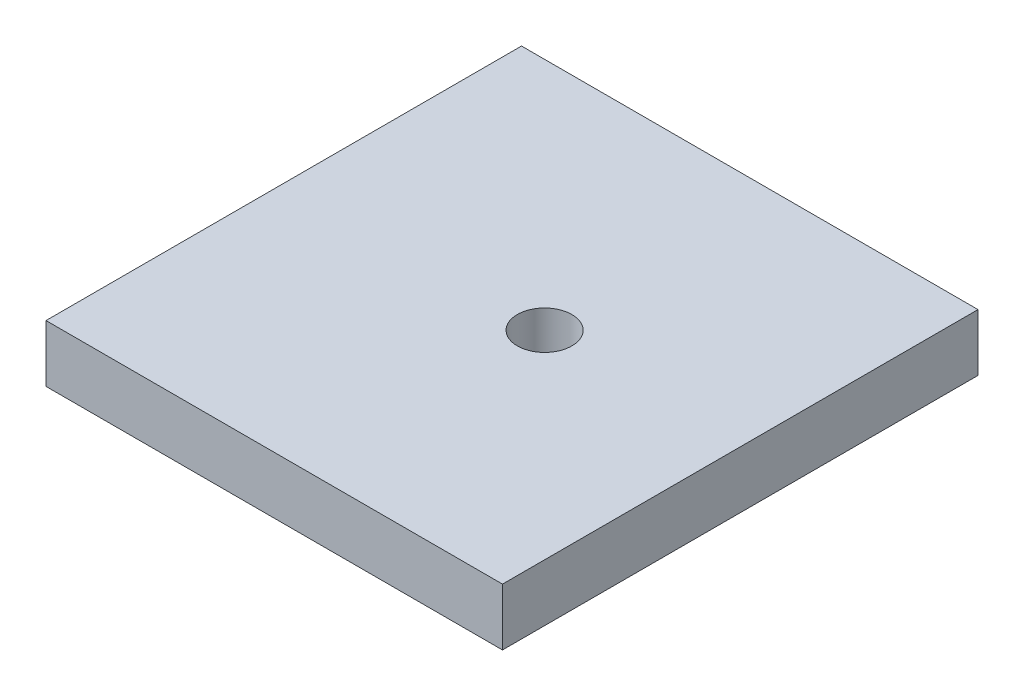
ISO-10303-21;
HEADER;
FILE_DESCRIPTION(('STEP AP214'),'2;1');
FILE_NAME('part.step','',(''),(''),'','','');
FILE_SCHEMA(('AUTOMOTIVE_DESIGN { 1 0 10303 214 1 1 1 1 }'));
ENDSEC;
DATA;
#1=APPLICATION_CONTEXT('core data for automotive mechanical design processes');
#2=APPLICATION_PROTOCOL_DEFINITION('international standard','automotive_design',2000,#1);
#3=PRODUCT_CONTEXT('',#1,'mechanical');
#4=PRODUCT('Part','Part','',(#3));
#5=PRODUCT_RELATED_PRODUCT_CATEGORY('part','',(#4));
#6=PRODUCT_DEFINITION_FORMATION('','',#4);
#7=PRODUCT_DEFINITION_CONTEXT('part definition',#1,'design');
#8=PRODUCT_DEFINITION('design','',#6,#7);
#9=PRODUCT_DEFINITION_SHAPE('','',#8);
#10=(LENGTH_UNIT() NAMED_UNIT(*) SI_UNIT(.MILLI.,.METRE.));
#11=(NAMED_UNIT(*) PLANE_ANGLE_UNIT() SI_UNIT($,.RADIAN.));
#12=(NAMED_UNIT(*) SI_UNIT($,.STERADIAN.) SOLID_ANGLE_UNIT());
#13=UNCERTAINTY_MEASURE_WITH_UNIT(LENGTH_MEASURE(1.E-05),#10,'distance_accuracy_value','');
#14=(GEOMETRIC_REPRESENTATION_CONTEXT(3) GLOBAL_UNCERTAINTY_ASSIGNED_CONTEXT((#13)) GLOBAL_UNIT_ASSIGNED_CONTEXT((#10,
#11,#12)) REPRESENTATION_CONTEXT('',''));
#15=CARTESIAN_POINT('',(0.,0.,0.));
#16=DIRECTION('',(0.,0.,1.));
#17=DIRECTION('',(1.,0.,0.));
#18=AXIS2_PLACEMENT_3D('',#15,#16,#17);
#19=CARTESIAN_POINT('',(-24.6644987695894,4.5,-9.6149740966196));
#20=DIRECTION('',(1.,0.,0.));
#21=DIRECTION('',(0.,0.,-1.));
#22=AXIS2_PLACEMENT_3D('',#19,#20,#21);
#23=PLANE('',#22);
#24=DIRECTION('',(0.,0.,1.));
#25=VECTOR('',#24,1.);
#26=CARTESIAN_POINT('',(-24.6644987695894,0.,-9.6149740966196));
#27=LINE('',#26,#25);
#28=CARTESIAN_POINT('',(-24.6644987695894,0.,-9.6149740966196));
#29=VERTEX_POINT('',#28);
#30=CARTESIAN_POINT('',(-24.6644987695894,0.,27.8850259033804));
#31=VERTEX_POINT('',#30);
#32=EDGE_CURVE('E111',#29,#31,#27,.T.);
#33=ORIENTED_EDGE('',*,*,#32,.T.);
#34=DIRECTION('',(0.,-1.,0.));
#35=VECTOR('',#34,1.);
#36=CARTESIAN_POINT('',(-24.6644987695894,4.5,27.8850259033804));
#37=LINE('',#36,#35);
#38=CARTESIAN_POINT('',(-24.6644987695894,4.5,27.8850259033804));
#39=VERTEX_POINT('',#38);
#40=EDGE_CURVE('E12',#39,#31,#37,.T.);
#41=ORIENTED_EDGE('',*,*,#40,.F.);
#42=DIRECTION('',(0.,0.,1.));
#43=VECTOR('',#42,1.);
#44=CARTESIAN_POINT('',(-24.6644987695894,4.5,-9.6149740966196));
#45=LINE('',#44,#43);
#46=CARTESIAN_POINT('',(-24.6644987695894,4.5,-9.6149740966196));
#47=VERTEX_POINT('',#46);
#48=EDGE_CURVE('E86',#47,#39,#45,.T.);
#49=ORIENTED_EDGE('',*,*,#48,.F.);
#50=DIRECTION('',(0.,-1.,0.));
#51=VECTOR('',#50,1.);
#52=CARTESIAN_POINT('',(-24.6644987695894,4.5,-9.6149740966196));
#53=LINE('',#52,#51);
#54=EDGE_CURVE('E94',#47,#29,#53,.T.);
#55=ORIENTED_EDGE('',*,*,#54,.T.);
#56=EDGE_LOOP('',(#33,#41,#49,#55));
#57=FACE_BOUND('',#56,.T.);
#58=ADVANCED_FACE('F35',(#57),#23,.F.);
#59=CARTESIAN_POINT('',(-24.6644987695894,4.5,27.8850259033804));
#60=DIRECTION('',(0.,0.,-1.));
#61=DIRECTION('',(-1.,0.,0.));
#62=AXIS2_PLACEMENT_3D('',#59,#60,#61);
#63=PLANE('',#62);
#64=DIRECTION('',(1.,0.,0.));
#65=VECTOR('',#64,1.);
#66=CARTESIAN_POINT('',(-24.6644987695894,0.,27.8850259033804));
#67=LINE('',#66,#65);
#68=CARTESIAN_POINT('',(11.3355012304106,0.,27.8850259033804));
#69=VERTEX_POINT('',#68);
#70=EDGE_CURVE('E90',#31,#69,#67,.T.);
#71=ORIENTED_EDGE('',*,*,#70,.T.);
#72=DIRECTION('',(0.,-1.,0.));
#73=VECTOR('',#72,1.);
#74=CARTESIAN_POINT('',(11.3355012304106,4.5,27.8850259033804));
#75=LINE('',#74,#73);
#76=CARTESIAN_POINT('',(11.3355012304106,4.5,27.8850259033804));
#77=VERTEX_POINT('',#76);
#78=EDGE_CURVE('E43',#77,#69,#75,.T.);
#79=ORIENTED_EDGE('',*,*,#78,.F.);
#80=DIRECTION('',(1.,0.,0.));
#81=VECTOR('',#80,1.);
#82=CARTESIAN_POINT('',(-24.6644987695894,4.5,27.8850259033804));
#83=LINE('',#82,#81);
#84=EDGE_CURVE('E81',#39,#77,#83,.T.);
#85=ORIENTED_EDGE('',*,*,#84,.F.);
#86=ORIENTED_EDGE('',*,*,#40,.T.);
#87=EDGE_LOOP('',(#71,#79,#85,#86));
#88=FACE_BOUND('',#87,.T.);
#89=ADVANCED_FACE('F89',(#88),#63,.F.);
#90=CARTESIAN_POINT('',(11.3355012304106,4.5,-9.6149740966196));
#91=DIRECTION('',(-1.,0.,0.));
#92=DIRECTION('',(0.,0.,1.));
#93=AXIS2_PLACEMENT_3D('',#90,#91,#92);
#94=PLANE('',#93);
#95=DIRECTION('',(0.,0.,-1.));
#96=VECTOR('',#95,1.);
#97=CARTESIAN_POINT('',(11.3355012304106,0.,-9.6149740966196));
#98=LINE('',#97,#96);
#99=CARTESIAN_POINT('',(11.3355012304106,0.,-9.6149740966196));
#100=VERTEX_POINT('',#99);
#101=EDGE_CURVE('E68',#69,#100,#98,.T.);
#102=ORIENTED_EDGE('',*,*,#101,.T.);
#103=DIRECTION('',(0.,-1.,0.));
#104=VECTOR('',#103,1.);
#105=CARTESIAN_POINT('',(11.3355012304106,4.5,-9.6149740966196));
#106=LINE('',#105,#104);
#107=CARTESIAN_POINT('',(11.3355012304106,4.5,-9.6149740966196));
#108=VERTEX_POINT('',#107);
#109=EDGE_CURVE('E91',#108,#100,#106,.T.);
#110=ORIENTED_EDGE('',*,*,#109,.F.);
#111=DIRECTION('',(0.,0.,-1.));
#112=VECTOR('',#111,1.);
#113=CARTESIAN_POINT('',(11.3355012304106,4.5,-9.6149740966196));
#114=LINE('',#113,#112);
#115=EDGE_CURVE('E84',#77,#108,#114,.T.);
#116=ORIENTED_EDGE('',*,*,#115,.F.);
#117=ORIENTED_EDGE('',*,*,#78,.T.);
#118=EDGE_LOOP('',(#102,#110,#116,#117));
#119=FACE_BOUND('',#118,.T.);
#120=ADVANCED_FACE('F92',(#119),#94,.F.);
#121=CARTESIAN_POINT('',(-24.6644987695894,4.5,-9.6149740966196));
#122=DIRECTION('',(0.,0.,1.));
#123=DIRECTION('',(1.,0.,0.));
#124=AXIS2_PLACEMENT_3D('',#121,#122,#123);
#125=PLANE('',#124);
#126=DIRECTION('',(-1.,0.,0.));
#127=VECTOR('',#126,1.);
#128=CARTESIAN_POINT('',(-24.6644987695894,0.,-9.6149740966196));
#129=LINE('',#128,#127);
#130=EDGE_CURVE('E74',#100,#29,#129,.T.);
#131=ORIENTED_EDGE('',*,*,#130,.T.);
#132=ORIENTED_EDGE('',*,*,#54,.F.);
#133=DIRECTION('',(-1.,0.,0.));
#134=VECTOR('',#133,1.);
#135=CARTESIAN_POINT('',(-24.6644987695894,4.5,-9.6149740966196));
#136=LINE('',#135,#134);
#137=EDGE_CURVE('E51',#108,#47,#136,.T.);
#138=ORIENTED_EDGE('',*,*,#137,.F.);
#139=ORIENTED_EDGE('',*,*,#109,.T.);
#140=EDGE_LOOP('',(#131,#132,#138,#139));
#141=FACE_BOUND('',#140,.T.);
#142=ADVANCED_FACE('F122',(#141),#125,.F.);
#143=CARTESIAN_POINT('',(0.,4.5,0.));
#144=DIRECTION('',(0.,1.,0.));
#145=DIRECTION('',(0.,0.,1.));
#146=AXIS2_PLACEMENT_3D('',#143,#144,#145);
#147=PLANE('',#146);
#148=CARTESIAN_POINT('',(-4.34449876958943,4.5,8.8850259033804));
#149=DIRECTION('',(0.,1.,0.));
#150=DIRECTION('',(0.,0.,1.));
#151=AXIS2_PLACEMENT_3D('',#148,#149,#150);
#152=CIRCLE('',#151,2.15);
#153=CARTESIAN_POINT('',(-4.34449876958943,4.5,11.0350259033804));
#154=VERTEX_POINT('',#153);
#155=EDGE_CURVE('E105',#154,#154,#152,.T.);
#156=ORIENTED_EDGE('',*,*,#155,.F.);
#157=EDGE_LOOP('',(#156));
#158=FACE_BOUND('',#157,.T.);
#159=ORIENTED_EDGE('',*,*,#48,.T.);
#160=ORIENTED_EDGE('',*,*,#84,.T.);
#161=ORIENTED_EDGE('',*,*,#115,.T.);
#162=ORIENTED_EDGE('',*,*,#137,.T.);
#163=EDGE_LOOP('',(#159,#160,#161,#162));
#164=FACE_BOUND('',#163,.T.);
#165=ADVANCED_FACE('F82',(#158,#164),#147,.T.);
#166=CARTESIAN_POINT('',(0.,0.,0.));
#167=DIRECTION('',(0.,1.,0.));
#168=DIRECTION('',(0.,0.,1.));
#169=AXIS2_PLACEMENT_3D('',#166,#167,#168);
#170=PLANE('',#169);
#171=CARTESIAN_POINT('',(-4.34449876958943,0.,8.8850259033804));
#172=DIRECTION('',(0.,1.,0.));
#173=DIRECTION('',(0.,0.,1.));
#174=AXIS2_PLACEMENT_3D('',#171,#172,#173);
#175=CIRCLE('',#174,2.15);
#176=CARTESIAN_POINT('',(-4.34449876958943,0.,11.0350259033804));
#177=VERTEX_POINT('',#176);
#178=EDGE_CURVE('E109',#177,#177,#175,.T.);
#179=ORIENTED_EDGE('',*,*,#178,.T.);
#180=EDGE_LOOP('',(#179));
#181=FACE_BOUND('',#180,.T.);
#182=ORIENTED_EDGE('',*,*,#32,.F.);
#183=ORIENTED_EDGE('',*,*,#130,.F.);
#184=ORIENTED_EDGE('',*,*,#101,.F.);
#185=ORIENTED_EDGE('',*,*,#70,.F.);
#186=EDGE_LOOP('',(#182,#183,#184,#185));
#187=FACE_BOUND('',#186,.T.);
#188=ADVANCED_FACE('F124',(#181,#187),#170,.F.);
#189=CARTESIAN_POINT('',(-4.34449876958943,0.,8.8850259033804));
#190=DIRECTION('',(0.,1.,0.));
#191=DIRECTION('',(0.,0.,1.));
#192=AXIS2_PLACEMENT_3D('',#189,#190,#191);
#193=CYLINDRICAL_SURFACE('',#192,2.15);
#194=ORIENTED_EDGE('',*,*,#178,.F.);
#195=EDGE_LOOP('',(#194));
#196=FACE_BOUND('',#195,.T.);
#197=ORIENTED_EDGE('',*,*,#155,.T.);
#198=EDGE_LOOP('',(#197));
#199=FACE_BOUND('',#198,.T.);
#200=ADVANCED_FACE('F138',(#196,#199),#193,.F.);
#201=CLOSED_SHELL('',(#58,#89,#120,#142,#165,#188,#200));
#202=MANIFOLD_SOLID_BREP('B2',#201);
#203=ADVANCED_BREP_SHAPE_REPRESENTATION('',(#18,#202),#14);
#204=SHAPE_DEFINITION_REPRESENTATION(#9,#203);
ENDSEC;
END-ISO-10303-21;
